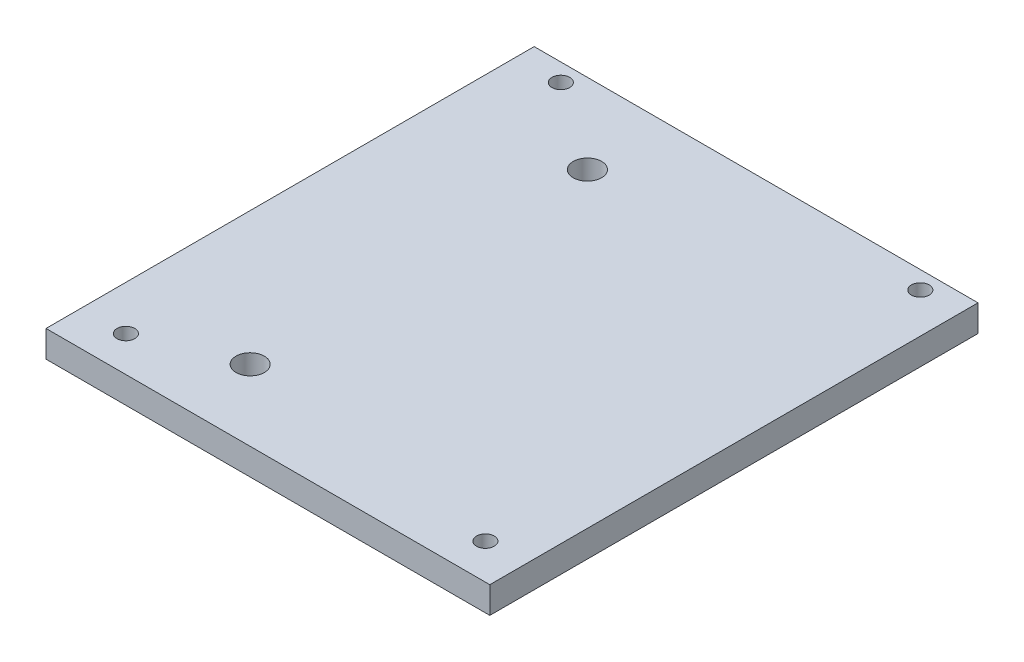
ISO-10303-21;
HEADER;
FILE_DESCRIPTION(('STEP AP214'),'2;1');
FILE_NAME('part.step','',(''),(''),'','','');
FILE_SCHEMA(('AUTOMOTIVE_DESIGN { 1 0 10303 214 1 1 1 1 }'));
ENDSEC;
DATA;
#1=APPLICATION_CONTEXT('core data for automotive mechanical design processes');
#2=APPLICATION_PROTOCOL_DEFINITION('international standard','automotive_design',2000,#1);
#3=PRODUCT_CONTEXT('',#1,'mechanical');
#4=PRODUCT('Part','Part','',(#3));
#5=PRODUCT_RELATED_PRODUCT_CATEGORY('part','',(#4));
#6=PRODUCT_DEFINITION_FORMATION('','',#4);
#7=PRODUCT_DEFINITION_CONTEXT('part definition',#1,'design');
#8=PRODUCT_DEFINITION('design','',#6,#7);
#9=PRODUCT_DEFINITION_SHAPE('','',#8);
#10=(LENGTH_UNIT() NAMED_UNIT(*) SI_UNIT(.MILLI.,.METRE.));
#11=(NAMED_UNIT(*) PLANE_ANGLE_UNIT() SI_UNIT($,.RADIAN.));
#12=(NAMED_UNIT(*) SI_UNIT($,.STERADIAN.) SOLID_ANGLE_UNIT());
#13=UNCERTAINTY_MEASURE_WITH_UNIT(LENGTH_MEASURE(1.E-05),#10,'distance_accuracy_value','');
#14=(GEOMETRIC_REPRESENTATION_CONTEXT(3) GLOBAL_UNCERTAINTY_ASSIGNED_CONTEXT((#13)) GLOBAL_UNIT_ASSIGNED_CONTEXT((#10,
#11,#12)) REPRESENTATION_CONTEXT('',''));
#15=CARTESIAN_POINT('',(0.,0.,0.));
#16=DIRECTION('',(0.,0.,1.));
#17=DIRECTION('',(1.,0.,0.));
#18=AXIS2_PLACEMENT_3D('',#15,#16,#17);
#19=CARTESIAN_POINT('',(0.,3.,0.));
#20=DIRECTION('',(0.,1.,0.));
#21=DIRECTION('',(0.,0.,1.));
#22=AXIS2_PLACEMENT_3D('',#19,#20,#21);
#23=PLANE('',#22);
#24=CARTESIAN_POINT('',(0.988991984154935,3.,21.8152042242958));
#25=DIRECTION('',(0.,1.,0.));
#26=DIRECTION('',(0.,0.,1.));
#27=AXIS2_PLACEMENT_3D('',#24,#25,#26);
#28=CIRCLE('',#27,1.);
#29=CARTESIAN_POINT('',(0.988991984154935,3.,22.8152042242958));
#30=VERTEX_POINT('',#29);
#31=EDGE_CURVE('E133',#30,#30,#28,.T.);
#32=ORIENTED_EDGE('',*,*,#31,.F.);
#33=EDGE_LOOP('',(#32));
#34=FACE_BOUND('',#33,.T.);
#35=CARTESIAN_POINT('',(-39.5110080158451,3.,-27.1847957757042));
#36=DIRECTION('',(0.,1.,0.));
#37=DIRECTION('',(0.,0.,1.));
#38=AXIS2_PLACEMENT_3D('',#35,#36,#37);
#39=CIRCLE('',#38,0.999999999999998);
#40=CARTESIAN_POINT('',(-39.5110080158451,3.,-26.1847957757042));
#41=VERTEX_POINT('',#40);
#42=EDGE_CURVE('E121',#41,#41,#39,.T.);
#43=ORIENTED_EDGE('',*,*,#42,.F.);
#44=EDGE_LOOP('',(#43));
#45=FACE_BOUND('',#44,.T.);
#46=CARTESIAN_POINT('',(-29.5110080158451,3.,-20.1847957757042));
#47=DIRECTION('',(0.,1.,0.));
#48=DIRECTION('',(0.,0.,1.));
#49=AXIS2_PLACEMENT_3D('',#46,#47,#48);
#50=CIRCLE('',#49,1.6);
#51=CARTESIAN_POINT('',(-29.5110080158451,3.,-18.5847957757042));
#52=VERTEX_POINT('',#51);
#53=EDGE_CURVE('E100',#52,#52,#50,.T.);
#54=ORIENTED_EDGE('',*,*,#53,.F.);
#55=EDGE_LOOP('',(#54));
#56=FACE_BOUND('',#55,.T.);
#57=DIRECTION('',(0.,0.,1.));
#58=VECTOR('',#57,1.);
#59=CARTESIAN_POINT('',(-44.5110080158451,3.,-29.1847957757042));
#60=LINE('',#59,#58);
#61=CARTESIAN_POINT('',(-44.5110080158451,3.,-29.1847957757042));
#62=VERTEX_POINT('',#61);
#63=CARTESIAN_POINT('',(-44.5110080158451,3.,25.8152042242958));
#64=VERTEX_POINT('',#63);
#65=EDGE_CURVE('E85',#62,#64,#60,.T.);
#66=ORIENTED_EDGE('',*,*,#65,.T.);
#67=DIRECTION('',(1.,0.,0.));
#68=VECTOR('',#67,1.);
#69=CARTESIAN_POINT('',(-44.5110080158451,3.,25.8152042242958));
#70=LINE('',#69,#68);
#71=CARTESIAN_POINT('',(5.48899198415494,3.,25.8152042242958));
#72=VERTEX_POINT('',#71);
#73=EDGE_CURVE('E80',#64,#72,#70,.T.);
#74=ORIENTED_EDGE('',*,*,#73,.T.);
#75=DIRECTION('',(0.,0.,-1.));
#76=VECTOR('',#75,1.);
#77=CARTESIAN_POINT('',(5.48899198415494,3.,-29.1847957757042));
#78=LINE('',#77,#76);
#79=CARTESIAN_POINT('',(5.48899198415494,3.,-29.1847957757042));
#80=VERTEX_POINT('',#79);
#81=EDGE_CURVE('E83',#72,#80,#78,.T.);
#82=ORIENTED_EDGE('',*,*,#81,.T.);
#83=DIRECTION('',(-1.,0.,0.));
#84=VECTOR('',#83,1.);
#85=CARTESIAN_POINT('',(-44.5110080158451,3.,-29.1847957757042));
#86=LINE('',#85,#84);
#87=EDGE_CURVE('E50',#80,#62,#86,.T.);
#88=ORIENTED_EDGE('',*,*,#87,.T.);
#89=EDGE_LOOP('',(#66,#74,#82,#88));
#90=FACE_BOUND('',#89,.T.);
#91=CARTESIAN_POINT('',(-29.5110080158451,3.,17.8152042242958));
#92=DIRECTION('',(0.,1.,0.));
#93=DIRECTION('',(0.,0.,1.));
#94=AXIS2_PLACEMENT_3D('',#91,#92,#93);
#95=CIRCLE('',#94,1.6);
#96=CARTESIAN_POINT('',(-29.5110080158451,3.,19.4152042242958));
#97=VERTEX_POINT('',#96);
#98=EDGE_CURVE('E115',#97,#97,#95,.T.);
#99=ORIENTED_EDGE('',*,*,#98,.F.);
#100=EDGE_LOOP('',(#99));
#101=FACE_BOUND('',#100,.T.);
#102=CARTESIAN_POINT('',(-39.5110080158451,3.,21.8152042242958));
#103=DIRECTION('',(0.,1.,0.));
#104=DIRECTION('',(0.,0.,1.));
#105=AXIS2_PLACEMENT_3D('',#102,#103,#104);
#106=CIRCLE('',#105,0.999999999999998);
#107=CARTESIAN_POINT('',(-39.5110080158451,3.,22.8152042242958));
#108=VERTEX_POINT('',#107);
#109=EDGE_CURVE('E127',#108,#108,#106,.T.);
#110=ORIENTED_EDGE('',*,*,#109,.F.);
#111=EDGE_LOOP('',(#110));
#112=FACE_BOUND('',#111,.T.);
#113=CARTESIAN_POINT('',(0.988991984154929,3.,-27.1847957757042));
#114=DIRECTION('',(0.,1.,0.));
#115=DIRECTION('',(0.,0.,1.));
#116=AXIS2_PLACEMENT_3D('',#113,#114,#115);
#117=CIRCLE('',#116,1.);
#118=CARTESIAN_POINT('',(0.988991984154929,3.,-26.1847957757042));
#119=VERTEX_POINT('',#118);
#120=EDGE_CURVE('E139',#119,#119,#117,.T.);
#121=ORIENTED_EDGE('',*,*,#120,.F.);
#122=EDGE_LOOP('',(#121));
#123=FACE_BOUND('',#122,.T.);
#124=ADVANCED_FACE('F33',(#34,#45,#56,#90,#101,#112,#123),#23,.T.);
#125=CARTESIAN_POINT('',(0.,0.,0.));
#126=DIRECTION('',(0.,1.,0.));
#127=DIRECTION('',(0.,0.,1.));
#128=AXIS2_PLACEMENT_3D('',#125,#126,#127);
#129=PLANE('',#128);
#130=DIRECTION('',(0.,0.,1.));
#131=VECTOR('',#130,1.);
#132=CARTESIAN_POINT('',(-44.5110080158451,0.,-29.1847957757042));
#133=LINE('',#132,#131);
#134=CARTESIAN_POINT('',(-44.5110080158451,0.,-29.1847957757042));
#135=VERTEX_POINT('',#134);
#136=CARTESIAN_POINT('',(-44.5110080158451,0.,25.8152042242958));
#137=VERTEX_POINT('',#136);
#138=EDGE_CURVE('E97',#135,#137,#133,.T.);
#139=ORIENTED_EDGE('',*,*,#138,.F.);
#140=DIRECTION('',(-1.,0.,0.));
#141=VECTOR('',#140,1.);
#142=CARTESIAN_POINT('',(-44.5110080158451,0.,-29.1847957757042));
#143=LINE('',#142,#141);
#144=CARTESIAN_POINT('',(5.48899198415494,0.,-29.1847957757042));
#145=VERTEX_POINT('',#144);
#146=EDGE_CURVE('E73',#145,#135,#143,.T.);
#147=ORIENTED_EDGE('',*,*,#146,.F.);
#148=DIRECTION('',(0.,0.,-1.));
#149=VECTOR('',#148,1.);
#150=CARTESIAN_POINT('',(5.48899198415494,0.,-29.1847957757042));
#151=LINE('',#150,#149);
#152=CARTESIAN_POINT('',(5.48899198415494,0.,25.8152042242958));
#153=VERTEX_POINT('',#152);
#154=EDGE_CURVE('E67',#153,#145,#151,.T.);
#155=ORIENTED_EDGE('',*,*,#154,.F.);
#156=DIRECTION('',(1.,0.,0.));
#157=VECTOR('',#156,1.);
#158=CARTESIAN_POINT('',(-44.5110080158451,0.,25.8152042242958));
#159=LINE('',#158,#157);
#160=EDGE_CURVE('E89',#137,#153,#159,.T.);
#161=ORIENTED_EDGE('',*,*,#160,.F.);
#162=EDGE_LOOP('',(#139,#147,#155,#161));
#163=FACE_BOUND('',#162,.T.);
#164=CARTESIAN_POINT('',(-29.5110080158451,0.,-20.1847957757042));
#165=DIRECTION('',(0.,1.,0.));
#166=DIRECTION('',(0.,0.,1.));
#167=AXIS2_PLACEMENT_3D('',#164,#165,#166);
#168=CIRCLE('',#167,1.6);
#169=CARTESIAN_POINT('',(-29.5110080158451,0.,-18.5847957757042));
#170=VERTEX_POINT('',#169);
#171=EDGE_CURVE('E112',#170,#170,#168,.T.);
#172=ORIENTED_EDGE('',*,*,#171,.T.);
#173=EDGE_LOOP('',(#172));
#174=FACE_BOUND('',#173,.T.);
#175=CARTESIAN_POINT('',(-29.5110080158451,0.,17.8152042242958));
#176=DIRECTION('',(0.,1.,0.));
#177=DIRECTION('',(0.,0.,1.));
#178=AXIS2_PLACEMENT_3D('',#175,#176,#177);
#179=CIRCLE('',#178,1.6);
#180=CARTESIAN_POINT('',(-29.5110080158451,0.,19.4152042242958));
#181=VERTEX_POINT('',#180);
#182=EDGE_CURVE('E118',#181,#181,#179,.T.);
#183=ORIENTED_EDGE('',*,*,#182,.T.);
#184=EDGE_LOOP('',(#183));
#185=FACE_BOUND('',#184,.T.);
#186=CARTESIAN_POINT('',(-39.5110080158451,0.,-27.1847957757042));
#187=DIRECTION('',(0.,1.,0.));
#188=DIRECTION('',(0.,0.,1.));
#189=AXIS2_PLACEMENT_3D('',#186,#187,#188);
#190=CIRCLE('',#189,0.999999999999998);
#191=CARTESIAN_POINT('',(-39.5110080158451,0.,-26.1847957757042));
#192=VERTEX_POINT('',#191);
#193=EDGE_CURVE('E124',#192,#192,#190,.T.);
#194=ORIENTED_EDGE('',*,*,#193,.T.);
#195=EDGE_LOOP('',(#194));
#196=FACE_BOUND('',#195,.T.);
#197=CARTESIAN_POINT('',(-39.5110080158451,0.,21.8152042242958));
#198=DIRECTION('',(0.,1.,0.));
#199=DIRECTION('',(0.,0.,1.));
#200=AXIS2_PLACEMENT_3D('',#197,#198,#199);
#201=CIRCLE('',#200,0.999999999999998);
#202=CARTESIAN_POINT('',(-39.5110080158451,0.,22.8152042242958));
#203=VERTEX_POINT('',#202);
#204=EDGE_CURVE('E130',#203,#203,#201,.T.);
#205=ORIENTED_EDGE('',*,*,#204,.T.);
#206=EDGE_LOOP('',(#205));
#207=FACE_BOUND('',#206,.T.);
#208=CARTESIAN_POINT('',(0.988991984154935,0.,21.8152042242958));
#209=DIRECTION('',(0.,1.,0.));
#210=DIRECTION('',(0.,0.,1.));
#211=AXIS2_PLACEMENT_3D('',#208,#209,#210);
#212=CIRCLE('',#211,1.);
#213=CARTESIAN_POINT('',(0.988991984154935,0.,22.8152042242958));
#214=VERTEX_POINT('',#213);
#215=EDGE_CURVE('E136',#214,#214,#212,.T.);
#216=ORIENTED_EDGE('',*,*,#215,.T.);
#217=EDGE_LOOP('',(#216));
#218=FACE_BOUND('',#217,.T.);
#219=CARTESIAN_POINT('',(0.988991984154929,0.,-27.1847957757042));
#220=DIRECTION('',(0.,1.,0.));
#221=DIRECTION('',(0.,0.,1.));
#222=AXIS2_PLACEMENT_3D('',#219,#220,#221);
#223=CIRCLE('',#222,1.);
#224=CARTESIAN_POINT('',(0.988991984154929,0.,-26.1847957757042));
#225=VERTEX_POINT('',#224);
#226=EDGE_CURVE('E142',#225,#225,#223,.T.);
#227=ORIENTED_EDGE('',*,*,#226,.T.);
#228=EDGE_LOOP('',(#227));
#229=FACE_BOUND('',#228,.T.);
#230=ADVANCED_FACE('F108',(#163,#174,#185,#196,#207,#218,#229),#129,.F.);
#231=CARTESIAN_POINT('',(-44.5110080158451,3.,-29.1847957757042));
#232=DIRECTION('',(1.,0.,0.));
#233=DIRECTION('',(0.,0.,-1.));
#234=AXIS2_PLACEMENT_3D('',#231,#232,#233);
#235=PLANE('',#234);
#236=ORIENTED_EDGE('',*,*,#138,.T.);
#237=DIRECTION('',(0.,-1.,0.));
#238=VECTOR('',#237,1.);
#239=CARTESIAN_POINT('',(-44.5110080158451,3.,25.8152042242958));
#240=LINE('',#239,#238);
#241=EDGE_CURVE('E11',#64,#137,#240,.T.);
#242=ORIENTED_EDGE('',*,*,#241,.F.);
#243=ORIENTED_EDGE('',*,*,#65,.F.);
#244=DIRECTION('',(0.,-1.,0.));
#245=VECTOR('',#244,1.);
#246=CARTESIAN_POINT('',(-44.5110080158451,3.,-29.1847957757042));
#247=LINE('',#246,#245);
#248=EDGE_CURVE('E93',#62,#135,#247,.T.);
#249=ORIENTED_EDGE('',*,*,#248,.T.);
#250=EDGE_LOOP('',(#236,#242,#243,#249));
#251=FACE_BOUND('',#250,.T.);
#252=ADVANCED_FACE('F35',(#251),#235,.F.);
#253=CARTESIAN_POINT('',(-44.5110080158451,3.,25.8152042242958));
#254=DIRECTION('',(0.,0.,-1.));
#255=DIRECTION('',(-1.,0.,0.));
#256=AXIS2_PLACEMENT_3D('',#253,#254,#255);
#257=PLANE('',#256);
#258=ORIENTED_EDGE('',*,*,#160,.T.);
#259=DIRECTION('',(0.,-1.,0.));
#260=VECTOR('',#259,1.);
#261=CARTESIAN_POINT('',(5.48899198415494,3.,25.8152042242958));
#262=LINE('',#261,#260);
#263=EDGE_CURVE('E42',#72,#153,#262,.T.);
#264=ORIENTED_EDGE('',*,*,#263,.F.);
#265=ORIENTED_EDGE('',*,*,#73,.F.);
#266=ORIENTED_EDGE('',*,*,#241,.T.);
#267=EDGE_LOOP('',(#258,#264,#265,#266));
#268=FACE_BOUND('',#267,.T.);
#269=ADVANCED_FACE('F88',(#268),#257,.F.);
#270=CARTESIAN_POINT('',(5.48899198415494,3.,-29.1847957757042));
#271=DIRECTION('',(-1.,0.,0.));
#272=DIRECTION('',(0.,0.,1.));
#273=AXIS2_PLACEMENT_3D('',#270,#271,#272);
#274=PLANE('',#273);
#275=ORIENTED_EDGE('',*,*,#154,.T.);
#276=DIRECTION('',(0.,-1.,0.));
#277=VECTOR('',#276,1.);
#278=CARTESIAN_POINT('',(5.48899198415494,3.,-29.1847957757042));
#279=LINE('',#278,#277);
#280=EDGE_CURVE('E90',#80,#145,#279,.T.);
#281=ORIENTED_EDGE('',*,*,#280,.F.);
#282=ORIENTED_EDGE('',*,*,#81,.F.);
#283=ORIENTED_EDGE('',*,*,#263,.T.);
#284=EDGE_LOOP('',(#275,#281,#282,#283));
#285=FACE_BOUND('',#284,.T.);
#286=ADVANCED_FACE('F91',(#285),#274,.F.);
#287=CARTESIAN_POINT('',(-44.5110080158451,3.,-29.1847957757042));
#288=DIRECTION('',(0.,0.,1.));
#289=DIRECTION('',(1.,0.,0.));
#290=AXIS2_PLACEMENT_3D('',#287,#288,#289);
#291=PLANE('',#290);
#292=ORIENTED_EDGE('',*,*,#146,.T.);
#293=ORIENTED_EDGE('',*,*,#248,.F.);
#294=ORIENTED_EDGE('',*,*,#87,.F.);
#295=ORIENTED_EDGE('',*,*,#280,.T.);
#296=EDGE_LOOP('',(#292,#293,#294,#295));
#297=FACE_BOUND('',#296,.T.);
#298=ADVANCED_FACE('F105',(#297),#291,.F.);
#299=CARTESIAN_POINT('',(-29.5110080158451,3.,-20.1847957757042));
#300=DIRECTION('',(0.,-1.,0.));
#301=DIRECTION('',(0.,0.,-1.));
#302=AXIS2_PLACEMENT_3D('',#299,#300,#301);
#303=CYLINDRICAL_SURFACE('',#302,1.6);
#304=ORIENTED_EDGE('',*,*,#53,.T.);
#305=EDGE_LOOP('',(#304));
#306=FACE_BOUND('',#305,.T.);
#307=ORIENTED_EDGE('',*,*,#171,.F.);
#308=EDGE_LOOP('',(#307));
#309=FACE_BOUND('',#308,.T.);
#310=ADVANCED_FACE('F161',(#306,#309),#303,.F.);
#311=CARTESIAN_POINT('',(-29.5110080158451,3.,17.8152042242958));
#312=DIRECTION('',(0.,-1.,0.));
#313=DIRECTION('',(0.,0.,-1.));
#314=AXIS2_PLACEMENT_3D('',#311,#312,#313);
#315=CYLINDRICAL_SURFACE('',#314,1.6);
#316=ORIENTED_EDGE('',*,*,#98,.T.);
#317=EDGE_LOOP('',(#316));
#318=FACE_BOUND('',#317,.T.);
#319=ORIENTED_EDGE('',*,*,#182,.F.);
#320=EDGE_LOOP('',(#319));
#321=FACE_BOUND('',#320,.T.);
#322=ADVANCED_FACE('F207',(#318,#321),#315,.F.);
#323=CARTESIAN_POINT('',(-39.5110080158451,3.,-27.1847957757042));
#324=DIRECTION('',(0.,-1.,0.));
#325=DIRECTION('',(0.,0.,-1.));
#326=AXIS2_PLACEMENT_3D('',#323,#324,#325);
#327=CYLINDRICAL_SURFACE('',#326,0.999999999999998);
#328=ORIENTED_EDGE('',*,*,#42,.T.);
#329=EDGE_LOOP('',(#328));
#330=FACE_BOUND('',#329,.T.);
#331=ORIENTED_EDGE('',*,*,#193,.F.);
#332=EDGE_LOOP('',(#331));
#333=FACE_BOUND('',#332,.T.);
#334=ADVANCED_FACE('F215',(#330,#333),#327,.F.);
#335=CARTESIAN_POINT('',(-39.5110080158451,3.,21.8152042242958));
#336=DIRECTION('',(0.,-1.,0.));
#337=DIRECTION('',(0.,0.,-1.));
#338=AXIS2_PLACEMENT_3D('',#335,#336,#337);
#339=CYLINDRICAL_SURFACE('',#338,0.999999999999998);
#340=ORIENTED_EDGE('',*,*,#109,.T.);
#341=EDGE_LOOP('',(#340));
#342=FACE_BOUND('',#341,.T.);
#343=ORIENTED_EDGE('',*,*,#204,.F.);
#344=EDGE_LOOP('',(#343));
#345=FACE_BOUND('',#344,.T.);
#346=ADVANCED_FACE('F223',(#342,#345),#339,.F.);
#347=CARTESIAN_POINT('',(0.988991984154935,3.,21.8152042242958));
#348=DIRECTION('',(0.,-1.,0.));
#349=DIRECTION('',(0.,0.,-1.));
#350=AXIS2_PLACEMENT_3D('',#347,#348,#349);
#351=CYLINDRICAL_SURFACE('',#350,1.);
#352=ORIENTED_EDGE('',*,*,#31,.T.);
#353=EDGE_LOOP('',(#352));
#354=FACE_BOUND('',#353,.T.);
#355=ORIENTED_EDGE('',*,*,#215,.F.);
#356=EDGE_LOOP('',(#355));
#357=FACE_BOUND('',#356,.T.);
#358=ADVANCED_FACE('F232',(#354,#357),#351,.F.);
#359=CARTESIAN_POINT('',(0.988991984154929,3.,-27.1847957757042));
#360=DIRECTION('',(0.,-1.,0.));
#361=DIRECTION('',(0.,0.,-1.));
#362=AXIS2_PLACEMENT_3D('',#359,#360,#361);
#363=CYLINDRICAL_SURFACE('',#362,1.);
#364=ORIENTED_EDGE('',*,*,#120,.T.);
#365=EDGE_LOOP('',(#364));
#366=FACE_BOUND('',#365,.T.);
#367=ORIENTED_EDGE('',*,*,#226,.F.);
#368=EDGE_LOOP('',(#367));
#369=FACE_BOUND('',#368,.T.);
#370=ADVANCED_FACE('F148',(#366,#369),#363,.F.);
#371=CLOSED_SHELL('',(#124,#230,#252,#269,#286,#298,#310,#322,#334,#346,#358,#370));
#372=MANIFOLD_SOLID_BREP('B2',#371);
#373=ADVANCED_BREP_SHAPE_REPRESENTATION('',(#18,#372),#14);
#374=SHAPE_DEFINITION_REPRESENTATION(#9,#373);
ENDSEC;
END-ISO-10303-21;
